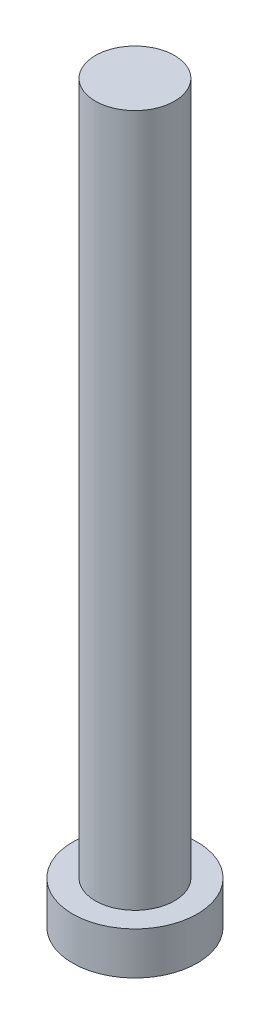
ISO-10303-21;
HEADER;
FILE_DESCRIPTION(('STEP AP214'),'2;1');
FILE_NAME('part.step','',(''),(''),'','','');
FILE_SCHEMA(('AUTOMOTIVE_DESIGN { 1 0 10303 214 1 1 1 1 }'));
ENDSEC;
DATA;
#1=APPLICATION_CONTEXT('core data for automotive mechanical design processes');
#2=APPLICATION_PROTOCOL_DEFINITION('international standard','automotive_design',2000,#1);
#3=PRODUCT_CONTEXT('',#1,'mechanical');
#4=PRODUCT('Part','Part','',(#3));
#5=PRODUCT_RELATED_PRODUCT_CATEGORY('part','',(#4));
#6=PRODUCT_DEFINITION_FORMATION('','',#4);
#7=PRODUCT_DEFINITION_CONTEXT('part definition',#1,'design');
#8=PRODUCT_DEFINITION('design','',#6,#7);
#9=PRODUCT_DEFINITION_SHAPE('','',#8);
#10=(LENGTH_UNIT() NAMED_UNIT(*) SI_UNIT(.MILLI.,.METRE.));
#11=(NAMED_UNIT(*) PLANE_ANGLE_UNIT() SI_UNIT($,.RADIAN.));
#12=(NAMED_UNIT(*) SI_UNIT($,.STERADIAN.) SOLID_ANGLE_UNIT());
#13=UNCERTAINTY_MEASURE_WITH_UNIT(LENGTH_MEASURE(1.E-05),#10,'distance_accuracy_value','');
#14=(GEOMETRIC_REPRESENTATION_CONTEXT(3) GLOBAL_UNCERTAINTY_ASSIGNED_CONTEXT((#13)) GLOBAL_UNIT_ASSIGNED_CONTEXT((#10,
#11,#12)) REPRESENTATION_CONTEXT('',''));
#15=CARTESIAN_POINT('',(0.,0.,0.));
#16=DIRECTION('',(0.,0.,1.));
#17=DIRECTION('',(1.,0.,0.));
#18=AXIS2_PLACEMENT_3D('',#15,#16,#17);
#19=CARTESIAN_POINT('',(0.,0.,0.));
#20=DIRECTION('',(0.,1.,0.));
#21=DIRECTION('',(0.,0.,1.));
#22=AXIS2_PLACEMENT_3D('',#19,#20,#21);
#23=PLANE('',#22);
#24=CARTESIAN_POINT('',(0.,0.,0.));
#25=DIRECTION('',(0.,1.,0.));
#26=DIRECTION('',(0.,0.,1.));
#27=AXIS2_PLACEMENT_3D('',#24,#25,#26);
#28=CIRCLE('',#27,3.15);
#29=CARTESIAN_POINT('',(0.,0.,3.15));
#30=VERTEX_POINT('',#29);
#31=EDGE_CURVE('E39',#30,#30,#28,.T.);
#32=ORIENTED_EDGE('',*,*,#31,.F.);
#33=EDGE_LOOP('',(#32));
#34=FACE_BOUND('',#33,.T.);
#35=CARTESIAN_POINT('',(1.,0.,1.));
#36=DIRECTION('',(0.,1.,0.));
#37=DIRECTION('',(0.,0.,-1.));
#38=AXIS2_PLACEMENT_3D('',#35,#36,#37);
#39=CIRCLE('',#38,0.5);
#40=CARTESIAN_POINT('',(1.,0.,0.5));
#41=VERTEX_POINT('',#40);
#42=CARTESIAN_POINT('',(0.5,0.,1.));
#43=VERTEX_POINT('',#42);
#44=EDGE_CURVE('E186',#41,#43,#39,.T.);
#45=ORIENTED_EDGE('',*,*,#44,.F.);
#46=DIRECTION('',(-1.,0.,0.));
#47=VECTOR('',#46,1.);
#48=CARTESIAN_POINT('',(1.,0.,0.5));
#49=LINE('',#48,#47);
#50=CARTESIAN_POINT('',(2.,0.,0.5));
#51=VERTEX_POINT('',#50);
#52=EDGE_CURVE('E52',#51,#41,#49,.T.);
#53=ORIENTED_EDGE('',*,*,#52,.F.);
#54=DIRECTION('',(0.,0.,1.));
#55=VECTOR('',#54,1.);
#56=CARTESIAN_POINT('',(2.,0.,-0.5));
#57=LINE('',#56,#55);
#58=CARTESIAN_POINT('',(2.,0.,-0.5));
#59=VERTEX_POINT('',#58);
#60=EDGE_CURVE('E225',#59,#51,#57,.T.);
#61=ORIENTED_EDGE('',*,*,#60,.F.);
#62=DIRECTION('',(1.,0.,0.));
#63=VECTOR('',#62,1.);
#64=CARTESIAN_POINT('',(1.,0.,-0.5));
#65=LINE('',#64,#63);
#66=CARTESIAN_POINT('',(1.,0.,-0.5));
#67=VERTEX_POINT('',#66);
#68=EDGE_CURVE('E223',#67,#59,#65,.T.);
#69=ORIENTED_EDGE('',*,*,#68,.F.);
#70=CARTESIAN_POINT('',(1.,0.,-1.));
#71=DIRECTION('',(0.,1.,0.));
#72=DIRECTION('',(0.,0.,-1.));
#73=AXIS2_PLACEMENT_3D('',#70,#71,#72);
#74=CIRCLE('',#73,0.5);
#75=CARTESIAN_POINT('',(0.500000000000001,0.,-1.));
#76=VERTEX_POINT('',#75);
#77=EDGE_CURVE('E160',#76,#67,#74,.T.);
#78=ORIENTED_EDGE('',*,*,#77,.F.);
#79=DIRECTION('',(0.,0.,1.));
#80=VECTOR('',#79,1.);
#81=CARTESIAN_POINT('',(0.500000000000001,0.,-2.));
#82=LINE('',#81,#80);
#83=CARTESIAN_POINT('',(0.500000000000001,0.,-2.));
#84=VERTEX_POINT('',#83);
#85=EDGE_CURVE('E219',#84,#76,#82,.T.);
#86=ORIENTED_EDGE('',*,*,#85,.F.);
#87=DIRECTION('',(1.,0.,0.));
#88=VECTOR('',#87,1.);
#89=CARTESIAN_POINT('',(-0.5,0.,-2.));
#90=LINE('',#89,#88);
#91=CARTESIAN_POINT('',(-0.5,0.,-2.));
#92=VERTEX_POINT('',#91);
#93=EDGE_CURVE('E216',#92,#84,#90,.T.);
#94=ORIENTED_EDGE('',*,*,#93,.F.);
#95=DIRECTION('',(0.,0.,-1.));
#96=VECTOR('',#95,1.);
#97=CARTESIAN_POINT('',(-0.5,0.,-2.));
#98=LINE('',#97,#96);
#99=CARTESIAN_POINT('',(-0.5,0.,-1.));
#100=VERTEX_POINT('',#99);
#101=EDGE_CURVE('E213',#100,#92,#98,.T.);
#102=ORIENTED_EDGE('',*,*,#101,.F.);
#103=CARTESIAN_POINT('',(-1.,0.,-1.));
#104=DIRECTION('',(0.,1.,0.));
#105=DIRECTION('',(0.,0.,-1.));
#106=AXIS2_PLACEMENT_3D('',#103,#104,#105);
#107=CIRCLE('',#106,0.5);
#108=CARTESIAN_POINT('',(-1.,0.,-0.5));
#109=VERTEX_POINT('',#108);
#110=EDGE_CURVE('E210',#109,#100,#107,.T.);
#111=ORIENTED_EDGE('',*,*,#110,.F.);
#112=DIRECTION('',(1.,0.,0.));
#113=VECTOR('',#112,1.);
#114=CARTESIAN_POINT('',(-2.,0.,-0.5));
#115=LINE('',#114,#113);
#116=CARTESIAN_POINT('',(-2.,0.,-0.5));
#117=VERTEX_POINT('',#116);
#118=EDGE_CURVE('E207',#117,#109,#115,.T.);
#119=ORIENTED_EDGE('',*,*,#118,.F.);
#120=DIRECTION('',(0.,0.,-1.));
#121=VECTOR('',#120,1.);
#122=CARTESIAN_POINT('',(-2.,0.,-0.5));
#123=LINE('',#122,#121);
#124=CARTESIAN_POINT('',(-2.,0.,0.5));
#125=VERTEX_POINT('',#124);
#126=EDGE_CURVE('E204',#125,#117,#123,.T.);
#127=ORIENTED_EDGE('',*,*,#126,.F.);
#128=DIRECTION('',(-1.,0.,0.));
#129=VECTOR('',#128,1.);
#130=CARTESIAN_POINT('',(-2.,0.,0.5));
#131=LINE('',#130,#129);
#132=CARTESIAN_POINT('',(-1.,0.,0.5));
#133=VERTEX_POINT('',#132);
#134=EDGE_CURVE('E201',#133,#125,#131,.T.);
#135=ORIENTED_EDGE('',*,*,#134,.F.);
#136=CARTESIAN_POINT('',(-1.,0.,1.));
#137=DIRECTION('',(0.,1.,0.));
#138=DIRECTION('',(0.,0.,1.));
#139=AXIS2_PLACEMENT_3D('',#136,#137,#138);
#140=CIRCLE('',#139,0.5);
#141=CARTESIAN_POINT('',(-0.5,0.,1.));
#142=VERTEX_POINT('',#141);
#143=EDGE_CURVE('E198',#142,#133,#140,.T.);
#144=ORIENTED_EDGE('',*,*,#143,.F.);
#145=DIRECTION('',(0.,0.,-1.));
#146=VECTOR('',#145,1.);
#147=CARTESIAN_POINT('',(-0.5,0.,1.));
#148=LINE('',#147,#146);
#149=CARTESIAN_POINT('',(-0.5,0.,2.));
#150=VERTEX_POINT('',#149);
#151=EDGE_CURVE('E195',#150,#142,#148,.T.);
#152=ORIENTED_EDGE('',*,*,#151,.F.);
#153=DIRECTION('',(-1.,0.,0.));
#154=VECTOR('',#153,1.);
#155=CARTESIAN_POINT('',(-0.5,0.,2.));
#156=LINE('',#155,#154);
#157=CARTESIAN_POINT('',(0.500000000000001,0.,2.));
#158=VERTEX_POINT('',#157);
#159=EDGE_CURVE('E192',#158,#150,#156,.T.);
#160=ORIENTED_EDGE('',*,*,#159,.F.);
#161=DIRECTION('',(0.,0.,1.));
#162=VECTOR('',#161,1.);
#163=CARTESIAN_POINT('',(0.5,0.,1.));
#164=LINE('',#163,#162);
#165=EDGE_CURVE('E189',#43,#158,#164,.T.);
#166=ORIENTED_EDGE('',*,*,#165,.F.);
#167=EDGE_LOOP('',(#45,#53,#61,#69,#78,#86,#94,#102,#111,#119,#127,#135,#144,#152,#160,#166));
#168=FACE_BOUND('',#167,.T.);
#169=ADVANCED_FACE('F35',(#34,#168),#23,.F.);
#170=CARTESIAN_POINT('',(0.,2.15,0.));
#171=DIRECTION('',(0.,-1.,0.));
#172=DIRECTION('',(0.,0.,-1.));
#173=AXIS2_PLACEMENT_3D('',#170,#171,#172);
#174=CYLINDRICAL_SURFACE('',#173,3.15);
#175=CARTESIAN_POINT('',(0.,2.15,0.));
#176=DIRECTION('',(0.,1.,0.));
#177=DIRECTION('',(0.,0.,1.));
#178=AXIS2_PLACEMENT_3D('',#175,#176,#177);
#179=CIRCLE('',#178,3.15);
#180=CARTESIAN_POINT('',(0.,2.15,3.15));
#181=VERTEX_POINT('',#180);
#182=EDGE_CURVE('E44',#181,#181,#179,.T.);
#183=ORIENTED_EDGE('',*,*,#182,.F.);
#184=EDGE_LOOP('',(#183));
#185=FACE_BOUND('',#184,.T.);
#186=ORIENTED_EDGE('',*,*,#31,.T.);
#187=EDGE_LOOP('',(#186));
#188=FACE_BOUND('',#187,.T.);
#189=ADVANCED_FACE('F37',(#185,#188),#174,.T.);
#190=CARTESIAN_POINT('',(0.,2.15,0.));
#191=DIRECTION('',(0.,1.,0.));
#192=DIRECTION('',(0.,0.,1.));
#193=AXIS2_PLACEMENT_3D('',#190,#191,#192);
#194=PLANE('',#193);
#195=CARTESIAN_POINT('',(0.,2.15,0.));
#196=DIRECTION('',(0.,1.,0.));
#197=DIRECTION('',(0.,0.,1.));
#198=AXIS2_PLACEMENT_3D('',#195,#196,#197);
#199=CIRCLE('',#198,2.);
#200=CARTESIAN_POINT('',(0.,2.15,2.));
#201=VERTEX_POINT('',#200);
#202=EDGE_CURVE('E11',#201,#201,#199,.T.);
#203=ORIENTED_EDGE('',*,*,#202,.F.);
#204=EDGE_LOOP('',(#203));
#205=FACE_BOUND('',#204,.T.);
#206=ORIENTED_EDGE('',*,*,#182,.T.);
#207=EDGE_LOOP('',(#206));
#208=FACE_BOUND('',#207,.T.);
#209=ADVANCED_FACE('F374',(#205,#208),#194,.T.);
#210=CARTESIAN_POINT('',(0.,37.15,0.));
#211=DIRECTION('',(0.,-1.,0.));
#212=DIRECTION('',(0.,0.,-1.));
#213=AXIS2_PLACEMENT_3D('',#210,#211,#212);
#214=CYLINDRICAL_SURFACE('',#213,2.);
#215=CARTESIAN_POINT('',(0.,37.15,0.));
#216=DIRECTION('',(0.,1.,0.));
#217=DIRECTION('',(0.,0.,1.));
#218=AXIS2_PLACEMENT_3D('',#215,#216,#217);
#219=CIRCLE('',#218,2.);
#220=CARTESIAN_POINT('',(0.,37.15,2.));
#221=VERTEX_POINT('',#220);
#222=EDGE_CURVE('E229',#221,#221,#219,.T.);
#223=ORIENTED_EDGE('',*,*,#222,.F.);
#224=EDGE_LOOP('',(#223));
#225=FACE_BOUND('',#224,.T.);
#226=ORIENTED_EDGE('',*,*,#202,.T.);
#227=EDGE_LOOP('',(#226));
#228=FACE_BOUND('',#227,.T.);
#229=ADVANCED_FACE('F370',(#225,#228),#214,.T.);
#230=CARTESIAN_POINT('',(0.,37.15,0.));
#231=DIRECTION('',(0.,1.,0.));
#232=DIRECTION('',(0.,0.,1.));
#233=AXIS2_PLACEMENT_3D('',#230,#231,#232);
#234=PLANE('',#233);
#235=ORIENTED_EDGE('',*,*,#222,.T.);
#236=EDGE_LOOP('',(#235));
#237=FACE_BOUND('',#236,.T.);
#238=ADVANCED_FACE('F320',(#237),#234,.T.);
#239=CARTESIAN_POINT('',(1.,1.5,0.5));
#240=DIRECTION('',(0.,0.,1.));
#241=DIRECTION('',(1.,0.,0.));
#242=AXIS2_PLACEMENT_3D('',#239,#240,#241);
#243=PLANE('',#242);
#244=ORIENTED_EDGE('',*,*,#52,.T.);
#245=DIRECTION('',(0.,-1.,0.));
#246=VECTOR('',#245,1.);
#247=CARTESIAN_POINT('',(1.,1.5,0.5));
#248=LINE('',#247,#246);
#249=CARTESIAN_POINT('',(1.,1.5,0.5));
#250=VERTEX_POINT('',#249);
#251=EDGE_CURVE('E112',#250,#41,#248,.T.);
#252=ORIENTED_EDGE('',*,*,#251,.F.);
#253=DIRECTION('',(-1.,0.,0.));
#254=VECTOR('',#253,1.);
#255=CARTESIAN_POINT('',(1.,1.5,0.5));
#256=LINE('',#255,#254);
#257=CARTESIAN_POINT('',(2.,1.5,0.5));
#258=VERTEX_POINT('',#257);
#259=EDGE_CURVE('E227',#258,#250,#256,.T.);
#260=ORIENTED_EDGE('',*,*,#259,.F.);
#261=DIRECTION('',(0.,-1.,0.));
#262=VECTOR('',#261,1.);
#263=CARTESIAN_POINT('',(2.,1.5,0.5));
#264=LINE('',#263,#262);
#265=EDGE_CURVE('E60',#258,#51,#264,.T.);
#266=ORIENTED_EDGE('',*,*,#265,.T.);
#267=EDGE_LOOP('',(#244,#252,#260,#266));
#268=FACE_BOUND('',#267,.T.);
#269=ADVANCED_FACE('F313',(#268),#243,.F.);
#270=CARTESIAN_POINT('',(2.,1.5,-0.5));
#271=DIRECTION('',(1.,0.,0.));
#272=DIRECTION('',(0.,0.,-1.));
#273=AXIS2_PLACEMENT_3D('',#270,#271,#272);
#274=PLANE('',#273);
#275=ORIENTED_EDGE('',*,*,#60,.T.);
#276=ORIENTED_EDGE('',*,*,#265,.F.);
#277=DIRECTION('',(0.,0.,1.));
#278=VECTOR('',#277,1.);
#279=CARTESIAN_POINT('',(2.,1.5,-0.5));
#280=LINE('',#279,#278);
#281=CARTESIAN_POINT('',(2.,1.5,-0.5));
#282=VERTEX_POINT('',#281);
#283=EDGE_CURVE('E172',#282,#258,#280,.T.);
#284=ORIENTED_EDGE('',*,*,#283,.F.);
#285=DIRECTION('',(0.,-1.,0.));
#286=VECTOR('',#285,1.);
#287=CARTESIAN_POINT('',(2.,1.5,-0.5));
#288=LINE('',#287,#286);
#289=EDGE_CURVE('E164',#282,#59,#288,.T.);
#290=ORIENTED_EDGE('',*,*,#289,.T.);
#291=EDGE_LOOP('',(#275,#276,#284,#290));
#292=FACE_BOUND('',#291,.T.);
#293=ADVANCED_FACE('F311',(#292),#274,.F.);
#294=CARTESIAN_POINT('',(1.,1.5,-0.5));
#295=DIRECTION('',(0.,0.,-1.));
#296=DIRECTION('',(-1.,0.,0.));
#297=AXIS2_PLACEMENT_3D('',#294,#295,#296);
#298=PLANE('',#297);
#299=ORIENTED_EDGE('',*,*,#68,.T.);
#300=ORIENTED_EDGE('',*,*,#289,.F.);
#301=DIRECTION('',(1.,0.,0.));
#302=VECTOR('',#301,1.);
#303=CARTESIAN_POINT('',(1.,1.5,-0.5));
#304=LINE('',#303,#302);
#305=CARTESIAN_POINT('',(1.,1.5,-0.5));
#306=VERTEX_POINT('',#305);
#307=EDGE_CURVE('E168',#306,#282,#304,.T.);
#308=ORIENTED_EDGE('',*,*,#307,.F.);
#309=DIRECTION('',(0.,-1.,0.));
#310=VECTOR('',#309,1.);
#311=CARTESIAN_POINT('',(1.,1.5,-0.5));
#312=LINE('',#311,#310);
#313=EDGE_CURVE('E153',#306,#67,#312,.T.);
#314=ORIENTED_EDGE('',*,*,#313,.T.);
#315=EDGE_LOOP('',(#299,#300,#308,#314));
#316=FACE_BOUND('',#315,.T.);
#317=ADVANCED_FACE('F169',(#316),#298,.F.);
#318=CARTESIAN_POINT('',(1.,1.5,-1.));
#319=DIRECTION('',(0.,-1.,0.));
#320=DIRECTION('',(0.,0.,-1.));
#321=AXIS2_PLACEMENT_3D('',#318,#319,#320);
#322=CYLINDRICAL_SURFACE('',#321,0.5);
#323=ORIENTED_EDGE('',*,*,#77,.T.);
#324=ORIENTED_EDGE('',*,*,#313,.F.);
#325=CARTESIAN_POINT('',(1.,1.5,-1.));
#326=DIRECTION('',(0.,1.,0.));
#327=DIRECTION('',(0.,0.,-1.));
#328=AXIS2_PLACEMENT_3D('',#325,#326,#327);
#329=CIRCLE('',#328,0.5);
#330=CARTESIAN_POINT('',(0.500000000000001,1.5,-1.));
#331=VERTEX_POINT('',#330);
#332=EDGE_CURVE('E157',#331,#306,#329,.T.);
#333=ORIENTED_EDGE('',*,*,#332,.F.);
#334=DIRECTION('',(0.,-1.,0.));
#335=VECTOR('',#334,1.);
#336=CARTESIAN_POINT('',(0.500000000000001,1.5,-1.));
#337=LINE('',#336,#335);
#338=EDGE_CURVE('E165',#331,#76,#337,.T.);
#339=ORIENTED_EDGE('',*,*,#338,.T.);
#340=EDGE_LOOP('',(#323,#324,#333,#339));
#341=FACE_BOUND('',#340,.T.);
#342=ADVANCED_FACE('F155',(#341),#322,.T.);
#343=CARTESIAN_POINT('',(0.500000000000001,1.5,-2.));
#344=DIRECTION('',(1.,0.,0.));
#345=DIRECTION('',(0.,0.,-1.));
#346=AXIS2_PLACEMENT_3D('',#343,#344,#345);
#347=PLANE('',#346);
#348=ORIENTED_EDGE('',*,*,#85,.T.);
#349=ORIENTED_EDGE('',*,*,#338,.F.);
#350=DIRECTION('',(0.,0.,1.));
#351=VECTOR('',#350,1.);
#352=CARTESIAN_POINT('',(0.500000000000001,1.5,-2.));
#353=LINE('',#352,#351);
#354=CARTESIAN_POINT('',(0.500000000000001,1.5,-2.));
#355=VERTEX_POINT('',#354);
#356=EDGE_CURVE('E178',#355,#331,#353,.T.);
#357=ORIENTED_EDGE('',*,*,#356,.F.);
#358=DIRECTION('',(0.,-1.,0.));
#359=VECTOR('',#358,1.);
#360=CARTESIAN_POINT('',(0.500000000000001,1.5,-2.));
#361=LINE('',#360,#359);
#362=EDGE_CURVE('E232',#355,#84,#361,.T.);
#363=ORIENTED_EDGE('',*,*,#362,.T.);
#364=EDGE_LOOP('',(#348,#349,#357,#363));
#365=FACE_BOUND('',#364,.T.);
#366=ADVANCED_FACE('F310',(#365),#347,.F.);
#367=CARTESIAN_POINT('',(-0.5,1.5,-2.));
#368=DIRECTION('',(0.,0.,-1.));
#369=DIRECTION('',(-1.,0.,0.));
#370=AXIS2_PLACEMENT_3D('',#367,#368,#369);
#371=PLANE('',#370);
#372=ORIENTED_EDGE('',*,*,#93,.T.);
#373=ORIENTED_EDGE('',*,*,#362,.F.);
#374=DIRECTION('',(1.,0.,0.));
#375=VECTOR('',#374,1.);
#376=CARTESIAN_POINT('',(-0.5,1.5,-2.));
#377=LINE('',#376,#375);
#378=CARTESIAN_POINT('',(-0.5,1.5,-2.));
#379=VERTEX_POINT('',#378);
#380=EDGE_CURVE('E180',#379,#355,#377,.T.);
#381=ORIENTED_EDGE('',*,*,#380,.F.);
#382=DIRECTION('',(0.,-1.,0.));
#383=VECTOR('',#382,1.);
#384=CARTESIAN_POINT('',(-0.5,1.5,-2.));
#385=LINE('',#384,#383);
#386=EDGE_CURVE('E234',#379,#92,#385,.T.);
#387=ORIENTED_EDGE('',*,*,#386,.T.);
#388=EDGE_LOOP('',(#372,#373,#381,#387));
#389=FACE_BOUND('',#388,.T.);
#390=ADVANCED_FACE('F306',(#389),#371,.F.);
#391=CARTESIAN_POINT('',(-0.5,1.5,-2.));
#392=DIRECTION('',(-1.,0.,0.));
#393=DIRECTION('',(0.,0.,1.));
#394=AXIS2_PLACEMENT_3D('',#391,#392,#393);
#395=PLANE('',#394);
#396=ORIENTED_EDGE('',*,*,#101,.T.);
#397=ORIENTED_EDGE('',*,*,#386,.F.);
#398=DIRECTION('',(0.,0.,-1.));
#399=VECTOR('',#398,1.);
#400=CARTESIAN_POINT('',(-0.5,1.5,-2.));
#401=LINE('',#400,#399);
#402=CARTESIAN_POINT('',(-0.5,1.5,-1.));
#403=VERTEX_POINT('',#402);
#404=EDGE_CURVE('E301',#403,#379,#401,.T.);
#405=ORIENTED_EDGE('',*,*,#404,.F.);
#406=DIRECTION('',(0.,-1.,0.));
#407=VECTOR('',#406,1.);
#408=CARTESIAN_POINT('',(-0.5,1.5,-1.));
#409=LINE('',#408,#407);
#410=EDGE_CURVE('E236',#403,#100,#409,.T.);
#411=ORIENTED_EDGE('',*,*,#410,.T.);
#412=EDGE_LOOP('',(#396,#397,#405,#411));
#413=FACE_BOUND('',#412,.T.);
#414=ADVANCED_FACE('F330',(#413),#395,.F.);
#415=CARTESIAN_POINT('',(-1.,1.5,-1.));
#416=DIRECTION('',(0.,-1.,0.));
#417=DIRECTION('',(0.,0.,-1.));
#418=AXIS2_PLACEMENT_3D('',#415,#416,#417);
#419=CYLINDRICAL_SURFACE('',#418,0.5);
#420=ORIENTED_EDGE('',*,*,#110,.T.);
#421=ORIENTED_EDGE('',*,*,#410,.F.);
#422=CARTESIAN_POINT('',(-1.,1.5,-1.));
#423=DIRECTION('',(0.,1.,0.));
#424=DIRECTION('',(0.,0.,-1.));
#425=AXIS2_PLACEMENT_3D('',#422,#423,#424);
#426=CIRCLE('',#425,0.5);
#427=CARTESIAN_POINT('',(-1.,1.5,-0.5));
#428=VERTEX_POINT('',#427);
#429=EDGE_CURVE('E298',#428,#403,#426,.T.);
#430=ORIENTED_EDGE('',*,*,#429,.F.);
#431=DIRECTION('',(0.,-1.,0.));
#432=VECTOR('',#431,1.);
#433=CARTESIAN_POINT('',(-1.,1.5,-0.5));
#434=LINE('',#433,#432);
#435=EDGE_CURVE('E238',#428,#109,#434,.T.);
#436=ORIENTED_EDGE('',*,*,#435,.T.);
#437=EDGE_LOOP('',(#420,#421,#430,#436));
#438=FACE_BOUND('',#437,.T.);
#439=ADVANCED_FACE('F333',(#438),#419,.T.);
#440=CARTESIAN_POINT('',(-2.,1.5,-0.5));
#441=DIRECTION('',(0.,0.,-1.));
#442=DIRECTION('',(-1.,0.,0.));
#443=AXIS2_PLACEMENT_3D('',#440,#441,#442);
#444=PLANE('',#443);
#445=ORIENTED_EDGE('',*,*,#118,.T.);
#446=ORIENTED_EDGE('',*,*,#435,.F.);
#447=DIRECTION('',(1.,0.,0.));
#448=VECTOR('',#447,1.);
#449=CARTESIAN_POINT('',(-2.,1.5,-0.5));
#450=LINE('',#449,#448);
#451=CARTESIAN_POINT('',(-2.,1.5,-0.5));
#452=VERTEX_POINT('',#451);
#453=EDGE_CURVE('E295',#452,#428,#450,.T.);
#454=ORIENTED_EDGE('',*,*,#453,.F.);
#455=DIRECTION('',(0.,-1.,0.));
#456=VECTOR('',#455,1.);
#457=CARTESIAN_POINT('',(-2.,1.5,-0.5));
#458=LINE('',#457,#456);
#459=EDGE_CURVE('E240',#452,#117,#458,.T.);
#460=ORIENTED_EDGE('',*,*,#459,.T.);
#461=EDGE_LOOP('',(#445,#446,#454,#460));
#462=FACE_BOUND('',#461,.T.);
#463=ADVANCED_FACE('F337',(#462),#444,.F.);
#464=CARTESIAN_POINT('',(-2.,1.5,-0.5));
#465=DIRECTION('',(-1.,0.,0.));
#466=DIRECTION('',(0.,0.,1.));
#467=AXIS2_PLACEMENT_3D('',#464,#465,#466);
#468=PLANE('',#467);
#469=ORIENTED_EDGE('',*,*,#126,.T.);
#470=ORIENTED_EDGE('',*,*,#459,.F.);
#471=DIRECTION('',(0.,0.,-1.));
#472=VECTOR('',#471,1.);
#473=CARTESIAN_POINT('',(-2.,1.5,-0.5));
#474=LINE('',#473,#472);
#475=CARTESIAN_POINT('',(-2.,1.5,0.5));
#476=VERTEX_POINT('',#475);
#477=EDGE_CURVE('E292',#476,#452,#474,.T.);
#478=ORIENTED_EDGE('',*,*,#477,.F.);
#479=DIRECTION('',(0.,-1.,0.));
#480=VECTOR('',#479,1.);
#481=CARTESIAN_POINT('',(-2.,1.5,0.5));
#482=LINE('',#481,#480);
#483=EDGE_CURVE('E242',#476,#125,#482,.T.);
#484=ORIENTED_EDGE('',*,*,#483,.T.);
#485=EDGE_LOOP('',(#469,#470,#478,#484));
#486=FACE_BOUND('',#485,.T.);
#487=ADVANCED_FACE('F341',(#486),#468,.F.);
#488=CARTESIAN_POINT('',(-2.,1.5,0.5));
#489=DIRECTION('',(0.,0.,1.));
#490=DIRECTION('',(1.,0.,0.));
#491=AXIS2_PLACEMENT_3D('',#488,#489,#490);
#492=PLANE('',#491);
#493=ORIENTED_EDGE('',*,*,#134,.T.);
#494=ORIENTED_EDGE('',*,*,#483,.F.);
#495=DIRECTION('',(-1.,0.,0.));
#496=VECTOR('',#495,1.);
#497=CARTESIAN_POINT('',(-2.,1.5,0.5));
#498=LINE('',#497,#496);
#499=CARTESIAN_POINT('',(-1.,1.5,0.5));
#500=VERTEX_POINT('',#499);
#501=EDGE_CURVE('E289',#500,#476,#498,.T.);
#502=ORIENTED_EDGE('',*,*,#501,.F.);
#503=DIRECTION('',(0.,-1.,0.));
#504=VECTOR('',#503,1.);
#505=CARTESIAN_POINT('',(-1.,1.5,0.5));
#506=LINE('',#505,#504);
#507=EDGE_CURVE('E244',#500,#133,#506,.T.);
#508=ORIENTED_EDGE('',*,*,#507,.T.);
#509=EDGE_LOOP('',(#493,#494,#502,#508));
#510=FACE_BOUND('',#509,.T.);
#511=ADVANCED_FACE('F345',(#510),#492,.F.);
#512=CARTESIAN_POINT('',(-1.,1.5,1.));
#513=DIRECTION('',(0.,-1.,0.));
#514=DIRECTION('',(0.,0.,-1.));
#515=AXIS2_PLACEMENT_3D('',#512,#513,#514);
#516=CYLINDRICAL_SURFACE('',#515,0.5);
#517=ORIENTED_EDGE('',*,*,#143,.T.);
#518=ORIENTED_EDGE('',*,*,#507,.F.);
#519=CARTESIAN_POINT('',(-1.,1.5,1.));
#520=DIRECTION('',(0.,1.,0.));
#521=DIRECTION('',(0.,0.,1.));
#522=AXIS2_PLACEMENT_3D('',#519,#520,#521);
#523=CIRCLE('',#522,0.5);
#524=CARTESIAN_POINT('',(-0.5,1.5,1.));
#525=VERTEX_POINT('',#524);
#526=EDGE_CURVE('E286',#525,#500,#523,.T.);
#527=ORIENTED_EDGE('',*,*,#526,.F.);
#528=DIRECTION('',(0.,-1.,0.));
#529=VECTOR('',#528,1.);
#530=CARTESIAN_POINT('',(-0.5,1.5,1.));
#531=LINE('',#530,#529);
#532=EDGE_CURVE('E246',#525,#142,#531,.T.);
#533=ORIENTED_EDGE('',*,*,#532,.T.);
#534=EDGE_LOOP('',(#517,#518,#527,#533));
#535=FACE_BOUND('',#534,.T.);
#536=ADVANCED_FACE('F349',(#535),#516,.T.);
#537=CARTESIAN_POINT('',(-0.5,1.5,1.));
#538=DIRECTION('',(-1.,0.,0.));
#539=DIRECTION('',(0.,0.,1.));
#540=AXIS2_PLACEMENT_3D('',#537,#538,#539);
#541=PLANE('',#540);
#542=ORIENTED_EDGE('',*,*,#151,.T.);
#543=ORIENTED_EDGE('',*,*,#532,.F.);
#544=DIRECTION('',(0.,0.,-1.));
#545=VECTOR('',#544,1.);
#546=CARTESIAN_POINT('',(-0.5,1.5,1.));
#547=LINE('',#546,#545);
#548=CARTESIAN_POINT('',(-0.5,1.5,2.));
#549=VERTEX_POINT('',#548);
#550=EDGE_CURVE('E283',#549,#525,#547,.T.);
#551=ORIENTED_EDGE('',*,*,#550,.F.);
#552=DIRECTION('',(0.,-1.,0.));
#553=VECTOR('',#552,1.);
#554=CARTESIAN_POINT('',(-0.5,1.5,2.));
#555=LINE('',#554,#553);
#556=EDGE_CURVE('E248',#549,#150,#555,.T.);
#557=ORIENTED_EDGE('',*,*,#556,.T.);
#558=EDGE_LOOP('',(#542,#543,#551,#557));
#559=FACE_BOUND('',#558,.T.);
#560=ADVANCED_FACE('F353',(#559),#541,.F.);
#561=CARTESIAN_POINT('',(-0.5,1.5,2.));
#562=DIRECTION('',(0.,0.,1.));
#563=DIRECTION('',(1.,0.,0.));
#564=AXIS2_PLACEMENT_3D('',#561,#562,#563);
#565=PLANE('',#564);
#566=ORIENTED_EDGE('',*,*,#159,.T.);
#567=ORIENTED_EDGE('',*,*,#556,.F.);
#568=DIRECTION('',(-1.,0.,0.));
#569=VECTOR('',#568,1.);
#570=CARTESIAN_POINT('',(-0.5,1.5,2.));
#571=LINE('',#570,#569);
#572=CARTESIAN_POINT('',(0.500000000000001,1.5,2.));
#573=VERTEX_POINT('',#572);
#574=EDGE_CURVE('E280',#573,#549,#571,.T.);
#575=ORIENTED_EDGE('',*,*,#574,.F.);
#576=DIRECTION('',(0.,-1.,0.));
#577=VECTOR('',#576,1.);
#578=CARTESIAN_POINT('',(0.500000000000001,1.5,2.));
#579=LINE('',#578,#577);
#580=EDGE_CURVE('E250',#573,#158,#579,.T.);
#581=ORIENTED_EDGE('',*,*,#580,.T.);
#582=EDGE_LOOP('',(#566,#567,#575,#581));
#583=FACE_BOUND('',#582,.T.);
#584=ADVANCED_FACE('F357',(#583),#565,.F.);
#585=CARTESIAN_POINT('',(0.5,1.5,1.));
#586=DIRECTION('',(1.,0.,0.));
#587=DIRECTION('',(0.,0.,-1.));
#588=AXIS2_PLACEMENT_3D('',#585,#586,#587);
#589=PLANE('',#588);
#590=ORIENTED_EDGE('',*,*,#165,.T.);
#591=ORIENTED_EDGE('',*,*,#580,.F.);
#592=DIRECTION('',(0.,0.,1.));
#593=VECTOR('',#592,1.);
#594=CARTESIAN_POINT('',(0.5,1.5,1.));
#595=LINE('',#594,#593);
#596=CARTESIAN_POINT('',(0.5,1.5,1.));
#597=VERTEX_POINT('',#596);
#598=EDGE_CURVE('E275',#597,#573,#595,.T.);
#599=ORIENTED_EDGE('',*,*,#598,.F.);
#600=DIRECTION('',(0.,-1.,0.));
#601=VECTOR('',#600,1.);
#602=CARTESIAN_POINT('',(0.5,1.5,1.));
#603=LINE('',#602,#601);
#604=EDGE_CURVE('E252',#597,#43,#603,.T.);
#605=ORIENTED_EDGE('',*,*,#604,.T.);
#606=EDGE_LOOP('',(#590,#591,#599,#605));
#607=FACE_BOUND('',#606,.T.);
#608=ADVANCED_FACE('F361',(#607),#589,.F.);
#609=CARTESIAN_POINT('',(1.,1.5,1.));
#610=DIRECTION('',(0.,-1.,0.));
#611=DIRECTION('',(0.,0.,-1.));
#612=AXIS2_PLACEMENT_3D('',#609,#610,#611);
#613=CYLINDRICAL_SURFACE('',#612,0.5);
#614=ORIENTED_EDGE('',*,*,#44,.T.);
#615=ORIENTED_EDGE('',*,*,#604,.F.);
#616=CARTESIAN_POINT('',(1.,1.5,1.));
#617=DIRECTION('',(0.,1.,0.));
#618=DIRECTION('',(0.,0.,-1.));
#619=AXIS2_PLACEMENT_3D('',#616,#617,#618);
#620=CIRCLE('',#619,0.5);
#621=EDGE_CURVE('E273',#250,#597,#620,.T.);
#622=ORIENTED_EDGE('',*,*,#621,.F.);
#623=ORIENTED_EDGE('',*,*,#251,.T.);
#624=EDGE_LOOP('',(#614,#615,#622,#623));
#625=FACE_BOUND('',#624,.T.);
#626=ADVANCED_FACE('F270',(#625),#613,.T.);
#627=CARTESIAN_POINT('',(1.,1.5,-1.));
#628=DIRECTION('',(0.,-1.,0.));
#629=DIRECTION('',(0.,0.,-1.));
#630=AXIS2_PLACEMENT_3D('',#627,#628,#629);
#631=PLANE('',#630);
#632=ORIENTED_EDGE('',*,*,#259,.T.);
#633=ORIENTED_EDGE('',*,*,#621,.T.);
#634=ORIENTED_EDGE('',*,*,#598,.T.);
#635=ORIENTED_EDGE('',*,*,#574,.T.);
#636=ORIENTED_EDGE('',*,*,#550,.T.);
#637=ORIENTED_EDGE('',*,*,#526,.T.);
#638=ORIENTED_EDGE('',*,*,#501,.T.);
#639=ORIENTED_EDGE('',*,*,#477,.T.);
#640=ORIENTED_EDGE('',*,*,#453,.T.);
#641=ORIENTED_EDGE('',*,*,#429,.T.);
#642=ORIENTED_EDGE('',*,*,#404,.T.);
#643=ORIENTED_EDGE('',*,*,#380,.T.);
#644=ORIENTED_EDGE('',*,*,#356,.T.);
#645=ORIENTED_EDGE('',*,*,#332,.T.);
#646=ORIENTED_EDGE('',*,*,#307,.T.);
#647=ORIENTED_EDGE('',*,*,#283,.T.);
#648=EDGE_LOOP('',(#632,#633,#634,#635,#636,#637,#638,#639,#640,#641,#642,#643,#644,#645,#646,#647));
#649=FACE_BOUND('',#648,.T.);
#650=ADVANCED_FACE('F175',(#649),#631,.T.);
#651=CLOSED_SHELL('',(#169,#189,#209,#229,#238,#269,#293,#317,#342,#366,#390,#414,#439,#463,
#487,#511,#536,#560,#584,#608,#626,#650));
#652=MANIFOLD_SOLID_BREP('B2',#651);
#653=ADVANCED_BREP_SHAPE_REPRESENTATION('',(#18,#652),#14);
#654=SHAPE_DEFINITION_REPRESENTATION(#9,#653);
ENDSEC;
END-ISO-10303-21;
